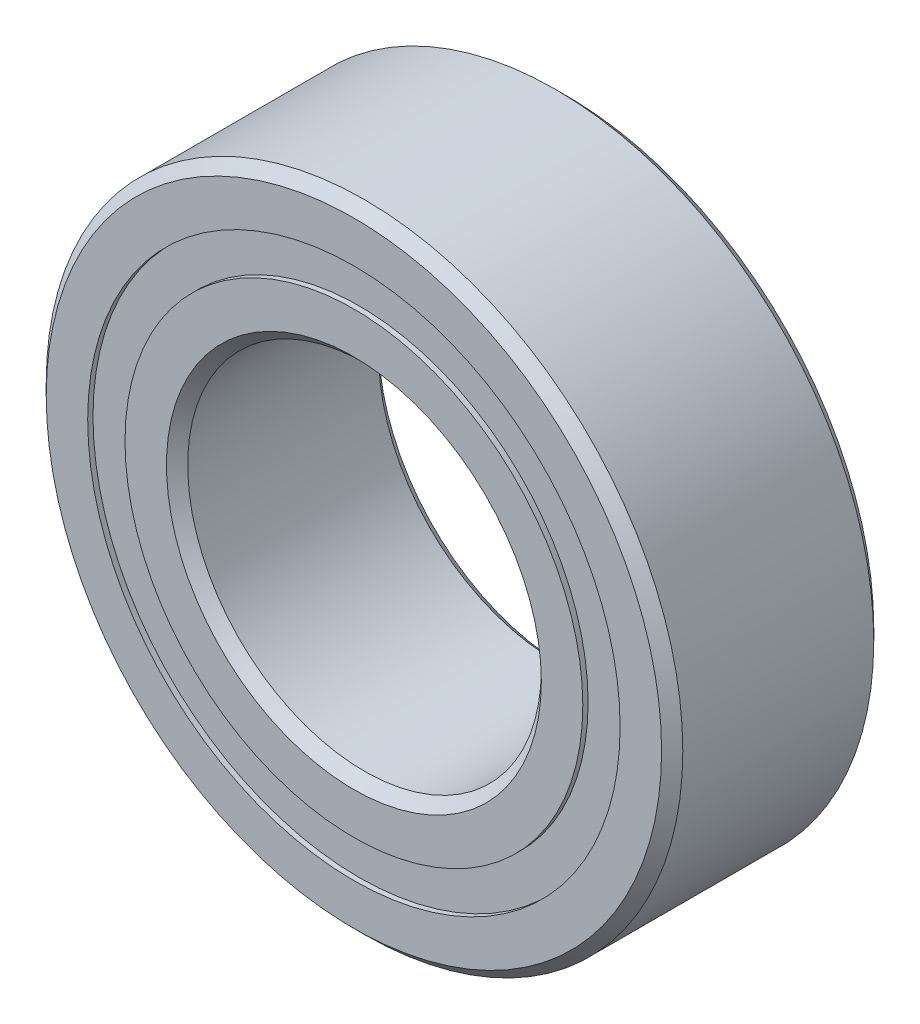
ISO-10303-21;
HEADER;
FILE_DESCRIPTION(('STEP AP214'),'2;1');
FILE_NAME('part.step','',(''),(''),'','','');
FILE_SCHEMA(('AUTOMOTIVE_DESIGN { 1 0 10303 214 1 1 1 1 }'));
ENDSEC;
DATA;
#1=APPLICATION_CONTEXT('core data for automotive mechanical design processes');
#2=APPLICATION_PROTOCOL_DEFINITION('international standard','automotive_design',2000,#1);
#3=PRODUCT_CONTEXT('',#1,'mechanical');
#4=PRODUCT('Part','Part','',(#3));
#5=PRODUCT_RELATED_PRODUCT_CATEGORY('part','',(#4));
#6=PRODUCT_DEFINITION_FORMATION('','',#4);
#7=PRODUCT_DEFINITION_CONTEXT('part definition',#1,'design');
#8=PRODUCT_DEFINITION('design','',#6,#7);
#9=PRODUCT_DEFINITION_SHAPE('','',#8);
#10=(LENGTH_UNIT() NAMED_UNIT(*) SI_UNIT(.MILLI.,.METRE.));
#11=(NAMED_UNIT(*) PLANE_ANGLE_UNIT() SI_UNIT($,.RADIAN.));
#12=(NAMED_UNIT(*) SI_UNIT($,.STERADIAN.) SOLID_ANGLE_UNIT());
#13=UNCERTAINTY_MEASURE_WITH_UNIT(LENGTH_MEASURE(1.E-05),#10,'distance_accuracy_value','');
#14=(GEOMETRIC_REPRESENTATION_CONTEXT(3) GLOBAL_UNCERTAINTY_ASSIGNED_CONTEXT((#13)) GLOBAL_UNIT_ASSIGNED_CONTEXT((#10,
#11,#12)) REPRESENTATION_CONTEXT('',''));
#15=CARTESIAN_POINT('',(0.,0.,0.));
#16=DIRECTION('',(0.,0.,1.));
#17=DIRECTION('',(1.,0.,0.));
#18=AXIS2_PLACEMENT_3D('',#15,#16,#17);
#19=CARTESIAN_POINT('',(0.,3.76373626373626,-1.425));
#20=DIRECTION('',(0.,0.,1.));
#21=DIRECTION('',(1.,0.,0.));
#22=AXIS2_PLACEMENT_3D('',#19,#20,#21);
#23=PLANE('',#22);
#24=CARTESIAN_POINT('',(0.,0.,-1.425));
#25=DIRECTION('',(0.,0.,1.));
#26=DIRECTION('',(1.,0.,0.));
#27=AXIS2_PLACEMENT_3D('',#24,#25,#26);
#28=CIRCLE('',#27,3.76373626373626);
#29=CARTESIAN_POINT('',(3.76373626373626,0.,-1.425));
#30=VERTEX_POINT('',#29);
#31=EDGE_CURVE('E59',#30,#30,#28,.T.);
#32=ORIENTED_EDGE('',*,*,#31,.F.);
#33=EDGE_LOOP('',(#32));
#34=FACE_BOUND('',#33,.T.);
#35=CARTESIAN_POINT('',(0.,0.,-1.425));
#36=DIRECTION('',(0.,0.,1.));
#37=DIRECTION('',(1.,0.,0.));
#38=AXIS2_PLACEMENT_3D('',#35,#36,#37);
#39=CIRCLE('',#38,3.23626373626374);
#40=CARTESIAN_POINT('',(3.23626373626374,0.,-1.425));
#41=VERTEX_POINT('',#40);
#42=EDGE_CURVE('E11',#41,#41,#39,.T.);
#43=ORIENTED_EDGE('',*,*,#42,.T.);
#44=EDGE_LOOP('',(#43));
#45=FACE_BOUND('',#44,.T.);
#46=ADVANCED_FACE('F45',(#34,#45),#23,.F.);
#47=CARTESIAN_POINT('',(0.,0.,1.5));
#48=DIRECTION('',(0.,0.,1.));
#49=DIRECTION('',(1.,0.,0.));
#50=AXIS2_PLACEMENT_3D('',#47,#48,#49);
#51=CYLINDRICAL_SURFACE('',#50,3.23626373626374);
#52=ORIENTED_EDGE('',*,*,#42,.F.);
#53=EDGE_LOOP('',(#52));
#54=FACE_BOUND('',#53,.T.);
#55=CARTESIAN_POINT('',(0.,0.,-0.716938812768572));
#56=DIRECTION('',(0.,0.,1.));
#57=DIRECTION('',(1.,0.,0.));
#58=AXIS2_PLACEMENT_3D('',#55,#56,#57);
#59=CIRCLE('',#58,3.23626373626374);
#60=CARTESIAN_POINT('',(3.23626373626374,0.,-0.716938812768572));
#61=VERTEX_POINT('',#60);
#62=EDGE_CURVE('E51',#61,#61,#59,.T.);
#63=ORIENTED_EDGE('',*,*,#62,.T.);
#64=EDGE_LOOP('',(#63));
#65=FACE_BOUND('',#64,.T.);
#66=ADVANCED_FACE('F68',(#54,#65),#51,.F.);
#67=CARTESIAN_POINT('',(0.,3.76373626373626,-0.716938812768571));
#68=DIRECTION('',(0.,0.,-1.));
#69=DIRECTION('',(-1.,0.,0.));
#70=AXIS2_PLACEMENT_3D('',#67,#68,#69);
#71=PLANE('',#70);
#72=ORIENTED_EDGE('',*,*,#62,.F.);
#73=EDGE_LOOP('',(#72));
#74=FACE_BOUND('',#73,.T.);
#75=CARTESIAN_POINT('',(0.,0.,-0.716938812768571));
#76=DIRECTION('',(0.,0.,1.));
#77=DIRECTION('',(1.,0.,0.));
#78=AXIS2_PLACEMENT_3D('',#75,#76,#77);
#79=CIRCLE('',#78,3.76373626373626);
#80=CARTESIAN_POINT('',(3.76373626373626,0.,-0.716938812768571));
#81=VERTEX_POINT('',#80);
#82=EDGE_CURVE('E55',#81,#81,#79,.T.);
#83=ORIENTED_EDGE('',*,*,#82,.T.);
#84=EDGE_LOOP('',(#83));
#85=FACE_BOUND('',#84,.T.);
#86=ADVANCED_FACE('F72',(#74,#85),#71,.F.);
#87=CARTESIAN_POINT('',(0.,0.,1.5));
#88=DIRECTION('',(0.,0.,1.));
#89=DIRECTION('',(1.,0.,0.));
#90=AXIS2_PLACEMENT_3D('',#87,#88,#89);
#91=CYLINDRICAL_SURFACE('',#90,3.76373626373626);
#92=ORIENTED_EDGE('',*,*,#82,.F.);
#93=EDGE_LOOP('',(#92));
#94=FACE_BOUND('',#93,.T.);
#95=ORIENTED_EDGE('',*,*,#31,.T.);
#96=EDGE_LOOP('',(#95));
#97=FACE_BOUND('',#96,.T.);
#98=ADVANCED_FACE('F65',(#94,#97),#91,.T.);
#99=CLOSED_SHELL('',(#46,#66,#86,#98));
#100=MANIFOLD_SOLID_BREP('B2',#99);
#101=CARTESIAN_POINT('',(0.,3.76373626373626,1.425));
#102=DIRECTION('',(0.,0.,-1.));
#103=DIRECTION('',(-1.,0.,0.));
#104=AXIS2_PLACEMENT_3D('',#101,#102,#103);
#105=PLANE('',#104);
#106=CARTESIAN_POINT('',(0.,0.,1.425));
#107=DIRECTION('',(0.,0.,1.));
#108=DIRECTION('',(1.,0.,0.));
#109=AXIS2_PLACEMENT_3D('',#106,#107,#108);
#110=CIRCLE('',#109,3.23626373626374);
#111=CARTESIAN_POINT('',(3.23626373626374,0.,1.425));
#112=VERTEX_POINT('',#111);
#113=EDGE_CURVE('E44',#112,#112,#110,.T.);
#114=ORIENTED_EDGE('',*,*,#113,.F.);
#115=EDGE_LOOP('',(#114));
#116=FACE_BOUND('',#115,.T.);
#117=CARTESIAN_POINT('',(0.,0.,1.425));
#118=DIRECTION('',(0.,0.,1.));
#119=DIRECTION('',(1.,0.,0.));
#120=AXIS2_PLACEMENT_3D('',#117,#118,#119);
#121=CIRCLE('',#120,3.76373626373626);
#122=CARTESIAN_POINT('',(3.76373626373626,0.,1.425));
#123=VERTEX_POINT('',#122);
#124=EDGE_CURVE('E126',#123,#123,#121,.T.);
#125=ORIENTED_EDGE('',*,*,#124,.T.);
#126=EDGE_LOOP('',(#125));
#127=FACE_BOUND('',#126,.T.);
#128=ADVANCED_FACE('F112',(#116,#127),#105,.F.);
#129=CARTESIAN_POINT('',(0.,0.,1.5));
#130=DIRECTION('',(0.,0.,1.));
#131=DIRECTION('',(1.,0.,0.));
#132=AXIS2_PLACEMENT_3D('',#129,#130,#131);
#133=CYLINDRICAL_SURFACE('',#132,3.23626373626374);
#134=CARTESIAN_POINT('',(0.,0.,0.716938812768571));
#135=DIRECTION('',(0.,0.,1.));
#136=DIRECTION('',(1.,0.,0.));
#137=AXIS2_PLACEMENT_3D('',#134,#135,#136);
#138=CIRCLE('',#137,3.23626373626374);
#139=CARTESIAN_POINT('',(3.23626373626374,0.,0.716938812768571));
#140=VERTEX_POINT('',#139);
#141=EDGE_CURVE('E118',#140,#140,#138,.T.);
#142=ORIENTED_EDGE('',*,*,#141,.F.);
#143=EDGE_LOOP('',(#142));
#144=FACE_BOUND('',#143,.T.);
#145=ORIENTED_EDGE('',*,*,#113,.T.);
#146=EDGE_LOOP('',(#145));
#147=FACE_BOUND('',#146,.T.);
#148=ADVANCED_FACE('F141',(#144,#147),#133,.F.);
#149=CARTESIAN_POINT('',(0.,3.76373626373626,0.716938812768571));
#150=DIRECTION('',(0.,0.,1.));
#151=DIRECTION('',(1.,0.,0.));
#152=AXIS2_PLACEMENT_3D('',#149,#150,#151);
#153=PLANE('',#152);
#154=CARTESIAN_POINT('',(0.,0.,0.716938812768571));
#155=DIRECTION('',(0.,0.,1.));
#156=DIRECTION('',(1.,0.,0.));
#157=AXIS2_PLACEMENT_3D('',#154,#155,#156);
#158=CIRCLE('',#157,3.76373626373626);
#159=CARTESIAN_POINT('',(3.76373626373626,0.,0.716938812768571));
#160=VERTEX_POINT('',#159);
#161=EDGE_CURVE('E122',#160,#160,#158,.T.);
#162=ORIENTED_EDGE('',*,*,#161,.F.);
#163=EDGE_LOOP('',(#162));
#164=FACE_BOUND('',#163,.T.);
#165=ORIENTED_EDGE('',*,*,#141,.T.);
#166=EDGE_LOOP('',(#165));
#167=FACE_BOUND('',#166,.T.);
#168=ADVANCED_FACE('F136',(#164,#167),#153,.F.);
#169=CARTESIAN_POINT('',(0.,0.,1.5));
#170=DIRECTION('',(0.,0.,1.));
#171=DIRECTION('',(1.,0.,0.));
#172=AXIS2_PLACEMENT_3D('',#169,#170,#171);
#173=CYLINDRICAL_SURFACE('',#172,3.76373626373626);
#174=ORIENTED_EDGE('',*,*,#124,.F.);
#175=EDGE_LOOP('',(#174));
#176=FACE_BOUND('',#175,.T.);
#177=ORIENTED_EDGE('',*,*,#161,.T.);
#178=EDGE_LOOP('',(#177));
#179=FACE_BOUND('',#178,.T.);
#180=ADVANCED_FACE('F133',(#176,#179),#173,.T.);
#181=CLOSED_SHELL('',(#128,#148,#168,#180));
#182=MANIFOLD_SOLID_BREP('B6',#181);
#183=CARTESIAN_POINT('',(-1.74999999999996,3.03108891324556,0.));
#184=DIRECTION('',(0.,0.,1.));
#185=DIRECTION('',(-0.499999999999989,0.866025403784445,0.));
#186=AXIS2_PLACEMENT_3D('',#183,#184,#185);
#187=SPHERICAL_SURFACE('',#186,0.716938812768571);
#188=CARTESIAN_POINT('',(-1.74999999999996,3.03108891324556,0.716938812768571));
#189=VERTEX_POINT('',#188);
#190=VERTEX_LOOP('',#189);
#191=FACE_BOUND('',#190,.T.);
#192=ADVANCED_FACE('F179',(#191),#187,.T.);
#193=CLOSED_SHELL('',(#192));
#194=MANIFOLD_SOLID_BREP('B39',#193);
#195=CARTESIAN_POINT('',(-3.03108891324551,1.75000000000004,0.));
#196=DIRECTION('',(0.,0.,1.));
#197=DIRECTION('',(-0.866025403784433,0.50000000000001,0.));
#198=AXIS2_PLACEMENT_3D('',#195,#196,#197);
#199=SPHERICAL_SURFACE('',#198,0.716938812768571);
#200=CARTESIAN_POINT('',(-3.03108891324551,1.75000000000004,0.716938812768571));
#201=VERTEX_POINT('',#200);
#202=VERTEX_LOOP('',#201);
#203=FACE_BOUND('',#202,.T.);
#204=ADVANCED_FACE('F199',(#203),#199,.T.);
#205=CLOSED_SHELL('',(#204));
#206=MANIFOLD_SOLID_BREP('B108',#205);
#207=CARTESIAN_POINT('',(-3.5,0.,0.));
#208=DIRECTION('',(0.,0.,1.));
#209=DIRECTION('',(-1.,0.,0.));
#210=AXIS2_PLACEMENT_3D('',#207,#208,#209);
#211=SPHERICAL_SURFACE('',#210,0.716938812768571);
#212=CARTESIAN_POINT('',(-3.5,0.,0.716938812768571));
#213=VERTEX_POINT('',#212);
#214=VERTEX_LOOP('',#213);
#215=FACE_BOUND('',#214,.T.);
#216=ADVANCED_FACE('F219',(#215),#211,.T.);
#217=CLOSED_SHELL('',(#216));
#218=MANIFOLD_SOLID_BREP('B175',#217);
#219=CARTESIAN_POINT('',(-3.03108891324555,-1.74999999999997,0.));
#220=DIRECTION('',(0.,0.,1.));
#221=DIRECTION('',(-0.866025403784443,-0.499999999999992,0.));
#222=AXIS2_PLACEMENT_3D('',#219,#220,#221);
#223=SPHERICAL_SURFACE('',#222,0.716938812768571);
#224=CARTESIAN_POINT('',(-3.03108891324555,-1.74999999999997,0.716938812768571));
#225=VERTEX_POINT('',#224);
#226=VERTEX_LOOP('',#225);
#227=FACE_BOUND('',#226,.T.);
#228=ADVANCED_FACE('F239',(#227),#223,.T.);
#229=CLOSED_SHELL('',(#228));
#230=MANIFOLD_SOLID_BREP('B195',#229);
#231=CARTESIAN_POINT('',(-1.75000000000002,-3.03108891324552,0.));
#232=DIRECTION('',(0.,0.,1.));
#233=DIRECTION('',(-0.500000000000007,-0.866025403784435,0.));
#234=AXIS2_PLACEMENT_3D('',#231,#232,#233);
#235=SPHERICAL_SURFACE('',#234,0.716938812768571);
#236=CARTESIAN_POINT('',(-1.75000000000002,-3.03108891324552,0.716938812768571));
#237=VERTEX_POINT('',#236);
#238=VERTEX_LOOP('',#237);
#239=FACE_BOUND('',#238,.T.);
#240=ADVANCED_FACE('F259',(#239),#235,.T.);
#241=CLOSED_SHELL('',(#240));
#242=MANIFOLD_SOLID_BREP('B215',#241);
#243=CARTESIAN_POINT('',(0.,-3.5,0.));
#244=DIRECTION('',(0.,0.,1.));
#245=DIRECTION('',(0.,-1.,0.));
#246=AXIS2_PLACEMENT_3D('',#243,#244,#245);
#247=SPHERICAL_SURFACE('',#246,0.716938812768571);
#248=CARTESIAN_POINT('',(0.,-3.5,0.716938812768571));
#249=VERTEX_POINT('',#248);
#250=VERTEX_LOOP('',#249);
#251=FACE_BOUND('',#250,.T.);
#252=ADVANCED_FACE('F279',(#251),#247,.T.);
#253=CLOSED_SHELL('',(#252));
#254=MANIFOLD_SOLID_BREP('B235',#253);
#255=CARTESIAN_POINT('',(1.74999999999998,-3.03108891324554,0.));
#256=DIRECTION('',(0.,0.,1.));
#257=DIRECTION('',(0.499999999999995,-0.866025403784442,0.));
#258=AXIS2_PLACEMENT_3D('',#255,#256,#257);
#259=SPHERICAL_SURFACE('',#258,0.716938812768571);
#260=CARTESIAN_POINT('',(1.74999999999998,-3.03108891324554,0.716938812768571));
#261=VERTEX_POINT('',#260);
#262=VERTEX_LOOP('',#261);
#263=FACE_BOUND('',#262,.T.);
#264=ADVANCED_FACE('F299',(#263),#259,.T.);
#265=CLOSED_SHELL('',(#264));
#266=MANIFOLD_SOLID_BREP('B255',#265);
#267=CARTESIAN_POINT('',(3.03108891324553,-1.75000000000001,0.));
#268=DIRECTION('',(0.,0.,1.));
#269=DIRECTION('',(0.866025403784436,-0.500000000000004,0.));
#270=AXIS2_PLACEMENT_3D('',#267,#268,#269);
#271=SPHERICAL_SURFACE('',#270,0.716938812768571);
#272=CARTESIAN_POINT('',(3.03108891324553,-1.75000000000001,0.716938812768571));
#273=VERTEX_POINT('',#272);
#274=VERTEX_LOOP('',#273);
#275=FACE_BOUND('',#274,.T.);
#276=ADVANCED_FACE('F319',(#275),#271,.T.);
#277=CLOSED_SHELL('',(#276));
#278=MANIFOLD_SOLID_BREP('B275',#277);
#279=CARTESIAN_POINT('',(3.5,0.,0.));
#280=DIRECTION('',(0.,0.,1.));
#281=DIRECTION('',(1.,0.,0.));
#282=AXIS2_PLACEMENT_3D('',#279,#280,#281);
#283=SPHERICAL_SURFACE('',#282,0.716938812768571);
#284=CARTESIAN_POINT('',(3.5,0.,0.716938812768571));
#285=VERTEX_POINT('',#284);
#286=VERTEX_LOOP('',#285);
#287=FACE_BOUND('',#286,.T.);
#288=ADVANCED_FACE('F339',(#287),#283,.T.);
#289=CLOSED_SHELL('',(#288));
#290=MANIFOLD_SOLID_BREP('B295',#289);
#291=CARTESIAN_POINT('',(3.03108891324554,1.74999999999999,0.));
#292=DIRECTION('',(0.,0.,1.));
#293=DIRECTION('',(0.86602540378444,0.499999999999998,0.));
#294=AXIS2_PLACEMENT_3D('',#291,#292,#293);
#295=SPHERICAL_SURFACE('',#294,0.716938812768571);
#296=CARTESIAN_POINT('',(3.03108891324554,1.74999999999999,0.716938812768571));
#297=VERTEX_POINT('',#296);
#298=VERTEX_LOOP('',#297);
#299=FACE_BOUND('',#298,.T.);
#300=ADVANCED_FACE('F359',(#299),#295,.T.);
#301=CLOSED_SHELL('',(#300));
#302=MANIFOLD_SOLID_BREP('B315',#301);
#303=CARTESIAN_POINT('',(1.75,3.03108891324553,0.));
#304=DIRECTION('',(0.,0.,1.));
#305=DIRECTION('',(0.500000000000001,0.866025403784438,0.));
#306=AXIS2_PLACEMENT_3D('',#303,#304,#305);
#307=SPHERICAL_SURFACE('',#306,0.716938812768571);
#308=CARTESIAN_POINT('',(1.75,3.03108891324553,0.716938812768571));
#309=VERTEX_POINT('',#308);
#310=VERTEX_LOOP('',#309);
#311=FACE_BOUND('',#310,.T.);
#312=ADVANCED_FACE('F379',(#311),#307,.T.);
#313=CLOSED_SHELL('',(#312));
#314=MANIFOLD_SOLID_BREP('B335',#313);
#315=CARTESIAN_POINT('',(0.,3.5,0.));
#316=DIRECTION('',(0.,0.,1.));
#317=DIRECTION('',(0.,1.,0.));
#318=AXIS2_PLACEMENT_3D('',#315,#316,#317);
#319=SPHERICAL_SURFACE('',#318,0.716938812768571);
#320=CARTESIAN_POINT('',(0.,3.5,0.716938812768571));
#321=VERTEX_POINT('',#320);
#322=VERTEX_LOOP('',#321);
#323=FACE_BOUND('',#322,.T.);
#324=ADVANCED_FACE('F401',(#323),#319,.T.);
#325=CLOSED_SHELL('',(#324));
#326=MANIFOLD_SOLID_BREP('B355',#325);
#327=CARTESIAN_POINT('',(0.,3.23626373626374,1.5));
#328=DIRECTION('',(0.,0.,-1.));
#329=DIRECTION('',(-1.,0.,0.));
#330=AXIS2_PLACEMENT_3D('',#327,#328,#329);
#331=PLANE('',#330);
#332=CARTESIAN_POINT('',(0.,0.,1.5));
#333=DIRECTION('',(0.,0.,1.));
#334=DIRECTION('',(1.,0.,0.));
#335=AXIS2_PLACEMENT_3D('',#332,#333,#334);
#336=CIRCLE('',#335,2.65);
#337=CARTESIAN_POINT('',(2.65,0.,1.5));
#338=VERTEX_POINT('',#337);
#339=EDGE_CURVE('E448',#338,#338,#336,.T.);
#340=ORIENTED_EDGE('',*,*,#339,.F.);
#341=EDGE_LOOP('',(#340));
#342=FACE_BOUND('',#341,.T.);
#343=CARTESIAN_POINT('',(0.,0.,1.5));
#344=DIRECTION('',(0.,0.,1.));
#345=DIRECTION('',(1.,0.,0.));
#346=AXIS2_PLACEMENT_3D('',#343,#344,#345);
#347=CIRCLE('',#346,3.23626373626374);
#348=CARTESIAN_POINT('',(3.23626373626374,0.,1.5));
#349=VERTEX_POINT('',#348);
#350=EDGE_CURVE('E400',#349,#349,#347,.T.);
#351=ORIENTED_EDGE('',*,*,#350,.T.);
#352=EDGE_LOOP('',(#351));
#353=FACE_BOUND('',#352,.T.);
#354=ADVANCED_FACE('F420',(#342,#353),#331,.F.);
#355=CARTESIAN_POINT('',(0.,0.,1.5));
#356=DIRECTION('',(0.,0.,1.));
#357=DIRECTION('',(1.,0.,0.));
#358=AXIS2_PLACEMENT_3D('',#355,#356,#357);
#359=CYLINDRICAL_SURFACE('',#358,3.23626373626374);
#360=ORIENTED_EDGE('',*,*,#350,.F.);
#361=EDGE_LOOP('',(#360));
#362=FACE_BOUND('',#361,.T.);
#363=CARTESIAN_POINT('',(0.,0.,0.666666666666667));
#364=DIRECTION('',(0.,0.,1.));
#365=DIRECTION('',(1.,0.,0.));
#366=AXIS2_PLACEMENT_3D('',#363,#364,#365);
#367=CIRCLE('',#366,3.23626373626374);
#368=CARTESIAN_POINT('',(3.23626373626374,0.,0.666666666666667));
#369=VERTEX_POINT('',#368);
#370=EDGE_CURVE('E426',#369,#369,#367,.T.);
#371=ORIENTED_EDGE('',*,*,#370,.T.);
#372=EDGE_LOOP('',(#371));
#373=FACE_BOUND('',#372,.T.);
#374=ADVANCED_FACE('F455',(#362,#373),#359,.T.);
#375=CARTESIAN_POINT('',(0.,0.,0.));
#376=DIRECTION('',(0.,0.,1.));
#377=DIRECTION('',(1.,0.,0.));
#378=AXIS2_PLACEMENT_3D('',#375,#376,#377);
#379=TOROIDAL_SURFACE('',#378,3.5,0.71693881276857);
#380=ORIENTED_EDGE('',*,*,#370,.F.);
#381=EDGE_LOOP('',(#380));
#382=FACE_BOUND('',#381,.T.);
#383=CARTESIAN_POINT('',(0.,0.,-0.666666666666667));
#384=DIRECTION('',(0.,0.,1.));
#385=DIRECTION('',(1.,0.,0.));
#386=AXIS2_PLACEMENT_3D('',#383,#384,#385);
#387=CIRCLE('',#386,3.23626373626374);
#388=CARTESIAN_POINT('',(3.23626373626374,0.,-0.666666666666667));
#389=VERTEX_POINT('',#388);
#390=EDGE_CURVE('E430',#389,#389,#387,.T.);
#391=ORIENTED_EDGE('',*,*,#390,.T.);
#392=EDGE_LOOP('',(#391));
#393=FACE_BOUND('',#392,.T.);
#394=ADVANCED_FACE('F459',(#382,#393),#379,.F.);
#395=CARTESIAN_POINT('',(0.,0.,1.5));
#396=DIRECTION('',(0.,0.,1.));
#397=DIRECTION('',(1.,0.,0.));
#398=AXIS2_PLACEMENT_3D('',#395,#396,#397);
#399=CYLINDRICAL_SURFACE('',#398,3.23626373626374);
#400=ORIENTED_EDGE('',*,*,#390,.F.);
#401=EDGE_LOOP('',(#400));
#402=FACE_BOUND('',#401,.T.);
#403=CARTESIAN_POINT('',(0.,0.,-1.5));
#404=DIRECTION('',(0.,0.,1.));
#405=DIRECTION('',(1.,0.,0.));
#406=AXIS2_PLACEMENT_3D('',#403,#404,#405);
#407=CIRCLE('',#406,3.23626373626374);
#408=CARTESIAN_POINT('',(3.23626373626374,0.,-1.5));
#409=VERTEX_POINT('',#408);
#410=EDGE_CURVE('E434',#409,#409,#407,.T.);
#411=ORIENTED_EDGE('',*,*,#410,.T.);
#412=EDGE_LOOP('',(#411));
#413=FACE_BOUND('',#412,.T.);
#414=ADVANCED_FACE('F464',(#402,#413),#399,.T.);
#415=CARTESIAN_POINT('',(0.,2.65,-1.5));
#416=DIRECTION('',(0.,0.,1.));
#417=DIRECTION('',(1.,0.,0.));
#418=AXIS2_PLACEMENT_3D('',#415,#416,#417);
#419=PLANE('',#418);
#420=ORIENTED_EDGE('',*,*,#410,.F.);
#421=EDGE_LOOP('',(#420));
#422=FACE_BOUND('',#421,.T.);
#423=CARTESIAN_POINT('',(0.,0.,-1.5));
#424=DIRECTION('',(0.,0.,1.));
#425=DIRECTION('',(1.,0.,0.));
#426=AXIS2_PLACEMENT_3D('',#423,#424,#425);
#427=CIRCLE('',#426,2.65);
#428=CARTESIAN_POINT('',(2.65,0.,-1.5));
#429=VERTEX_POINT('',#428);
#430=EDGE_CURVE('E439',#429,#429,#427,.T.);
#431=ORIENTED_EDGE('',*,*,#430,.T.);
#432=EDGE_LOOP('',(#431));
#433=FACE_BOUND('',#432,.T.);
#434=ADVANCED_FACE('F470',(#422,#433),#419,.F.);
#435=CARTESIAN_POINT('',(0.,0.,-1.35));
#436=DIRECTION('',(0.,0.,-1.));
#437=DIRECTION('',(-1.,0.,0.));
#438=AXIS2_PLACEMENT_3D('',#435,#436,#437);
#439=CONICAL_SURFACE('',#438,2.5,0.785398163397445);
#440=ORIENTED_EDGE('',*,*,#430,.F.);
#441=EDGE_LOOP('',(#440));
#442=FACE_BOUND('',#441,.T.);
#443=CARTESIAN_POINT('',(0.,0.,-1.35));
#444=DIRECTION('',(0.,0.,1.));
#445=DIRECTION('',(1.,0.,0.));
#446=AXIS2_PLACEMENT_3D('',#443,#444,#445);
#447=CIRCLE('',#446,2.5);
#448=CARTESIAN_POINT('',(2.5,0.,-1.35));
#449=VERTEX_POINT('',#448);
#450=EDGE_CURVE('E442',#449,#449,#447,.T.);
#451=ORIENTED_EDGE('',*,*,#450,.T.);
#452=EDGE_LOOP('',(#451));
#453=FACE_BOUND('',#452,.T.);
#454=ADVANCED_FACE('F474',(#442,#453),#439,.F.);
#455=CARTESIAN_POINT('',(0.,0.,1.5));
#456=DIRECTION('',(0.,0.,1.));
#457=DIRECTION('',(1.,0.,0.));
#458=AXIS2_PLACEMENT_3D('',#455,#456,#457);
#459=CYLINDRICAL_SURFACE('',#458,2.5);
#460=ORIENTED_EDGE('',*,*,#450,.F.);
#461=EDGE_LOOP('',(#460));
#462=FACE_BOUND('',#461,.T.);
#463=CARTESIAN_POINT('',(0.,0.,1.35));
#464=DIRECTION('',(0.,0.,1.));
#465=DIRECTION('',(1.,0.,0.));
#466=AXIS2_PLACEMENT_3D('',#463,#464,#465);
#467=CIRCLE('',#466,2.5);
#468=CARTESIAN_POINT('',(2.5,0.,1.35));
#469=VERTEX_POINT('',#468);
#470=EDGE_CURVE('E445',#469,#469,#467,.T.);
#471=ORIENTED_EDGE('',*,*,#470,.T.);
#472=EDGE_LOOP('',(#471));
#473=FACE_BOUND('',#472,.T.);
#474=ADVANCED_FACE('F478',(#462,#473),#459,.F.);
#475=CARTESIAN_POINT('',(0.,0.,1.5));
#476=DIRECTION('',(0.,0.,1.));
#477=DIRECTION('',(1.,0.,0.));
#478=AXIS2_PLACEMENT_3D('',#475,#476,#477);
#479=CONICAL_SURFACE('',#478,2.65,0.785398163397451);
#480=ORIENTED_EDGE('',*,*,#470,.F.);
#481=EDGE_LOOP('',(#480));
#482=FACE_BOUND('',#481,.T.);
#483=ORIENTED_EDGE('',*,*,#339,.T.);
#484=EDGE_LOOP('',(#483));
#485=FACE_BOUND('',#484,.T.);
#486=ADVANCED_FACE('F452',(#482,#485),#479,.F.);
#487=CLOSED_SHELL('',(#354,#374,#394,#414,#434,#454,#474,#486));
#488=MANIFOLD_SOLID_BREP('B375',#487);
#489=CARTESIAN_POINT('',(0.,0.,1.35));
#490=DIRECTION('',(0.,0.,-1.));
#491=DIRECTION('',(-1.,0.,0.));
#492=AXIS2_PLACEMENT_3D('',#489,#490,#491);
#493=CONICAL_SURFACE('',#492,4.5,0.785398163397445);
#494=CARTESIAN_POINT('',(0.,0.,1.5));
#495=DIRECTION('',(0.,0.,1.));
#496=DIRECTION('',(1.,0.,0.));
#497=AXIS2_PLACEMENT_3D('',#494,#495,#496);
#498=CIRCLE('',#497,4.35);
#499=CARTESIAN_POINT('',(4.35,0.,1.5));
#500=VERTEX_POINT('',#499);
#501=EDGE_CURVE('E569',#500,#500,#498,.T.);
#502=ORIENTED_EDGE('',*,*,#501,.F.);
#503=EDGE_LOOP('',(#502));
#504=FACE_BOUND('',#503,.T.);
#505=CARTESIAN_POINT('',(0.,0.,1.35));
#506=DIRECTION('',(0.,0.,1.));
#507=DIRECTION('',(1.,0.,0.));
#508=AXIS2_PLACEMENT_3D('',#505,#506,#507);
#509=CIRCLE('',#508,4.5);
#510=CARTESIAN_POINT('',(4.5,0.,1.35));
#511=VERTEX_POINT('',#510);
#512=EDGE_CURVE('E419',#511,#511,#509,.T.);
#513=ORIENTED_EDGE('',*,*,#512,.T.);
#514=EDGE_LOOP('',(#513));
#515=FACE_BOUND('',#514,.T.);
#516=ADVANCED_FACE('F541',(#504,#515),#493,.T.);
#517=CARTESIAN_POINT('',(0.,0.,1.5));
#518=DIRECTION('',(0.,0.,1.));
#519=DIRECTION('',(1.,0.,0.));
#520=AXIS2_PLACEMENT_3D('',#517,#518,#519);
#521=CYLINDRICAL_SURFACE('',#520,4.5);
#522=ORIENTED_EDGE('',*,*,#512,.F.);
#523=EDGE_LOOP('',(#522));
#524=FACE_BOUND('',#523,.T.);
#525=CARTESIAN_POINT('',(0.,0.,-1.35));
#526=DIRECTION('',(0.,0.,1.));
#527=DIRECTION('',(1.,0.,0.));
#528=AXIS2_PLACEMENT_3D('',#525,#526,#527);
#529=CIRCLE('',#528,4.5);
#530=CARTESIAN_POINT('',(4.5,0.,-1.35));
#531=VERTEX_POINT('',#530);
#532=EDGE_CURVE('E547',#531,#531,#529,.T.);
#533=ORIENTED_EDGE('',*,*,#532,.T.);
#534=EDGE_LOOP('',(#533));
#535=FACE_BOUND('',#534,.T.);
#536=ADVANCED_FACE('F576',(#524,#535),#521,.T.);
#537=CARTESIAN_POINT('',(0.,0.,-1.5));
#538=DIRECTION('',(0.,0.,1.));
#539=DIRECTION('',(1.,0.,0.));
#540=AXIS2_PLACEMENT_3D('',#537,#538,#539);
#541=CONICAL_SURFACE('',#540,4.35,0.785398163397445);
#542=ORIENTED_EDGE('',*,*,#532,.F.);
#543=EDGE_LOOP('',(#542));
#544=FACE_BOUND('',#543,.T.);
#545=CARTESIAN_POINT('',(0.,0.,-1.5));
#546=DIRECTION('',(0.,0.,1.));
#547=DIRECTION('',(1.,0.,0.));
#548=AXIS2_PLACEMENT_3D('',#545,#546,#547);
#549=CIRCLE('',#548,4.35);
#550=CARTESIAN_POINT('',(4.35,0.,-1.5));
#551=VERTEX_POINT('',#550);
#552=EDGE_CURVE('E551',#551,#551,#549,.T.);
#553=ORIENTED_EDGE('',*,*,#552,.T.);
#554=EDGE_LOOP('',(#553));
#555=FACE_BOUND('',#554,.T.);
#556=ADVANCED_FACE('F580',(#544,#555),#541,.T.);
#557=CARTESIAN_POINT('',(0.,4.35,-1.5));
#558=DIRECTION('',(0.,0.,1.));
#559=DIRECTION('',(1.,0.,0.));
#560=AXIS2_PLACEMENT_3D('',#557,#558,#559);
#561=PLANE('',#560);
#562=ORIENTED_EDGE('',*,*,#552,.F.);
#563=EDGE_LOOP('',(#562));
#564=FACE_BOUND('',#563,.T.);
#565=CARTESIAN_POINT('',(0.,0.,-1.5));
#566=DIRECTION('',(0.,0.,1.));
#567=DIRECTION('',(1.,0.,0.));
#568=AXIS2_PLACEMENT_3D('',#565,#566,#567);
#569=CIRCLE('',#568,3.76373626373626);
#570=CARTESIAN_POINT('',(3.76373626373626,0.,-1.5));
#571=VERTEX_POINT('',#570);
#572=EDGE_CURVE('E555',#571,#571,#569,.T.);
#573=ORIENTED_EDGE('',*,*,#572,.T.);
#574=EDGE_LOOP('',(#573));
#575=FACE_BOUND('',#574,.T.);
#576=ADVANCED_FACE('F585',(#564,#575),#561,.F.);
#577=CARTESIAN_POINT('',(0.,0.,1.5));
#578=DIRECTION('',(0.,0.,1.));
#579=DIRECTION('',(1.,0.,0.));
#580=AXIS2_PLACEMENT_3D('',#577,#578,#579);
#581=CYLINDRICAL_SURFACE('',#580,3.76373626373626);
#582=ORIENTED_EDGE('',*,*,#572,.F.);
#583=EDGE_LOOP('',(#582));
#584=FACE_BOUND('',#583,.T.);
#585=CARTESIAN_POINT('',(0.,0.,-0.666666666666667));
#586=DIRECTION('',(0.,0.,1.));
#587=DIRECTION('',(1.,0.,0.));
#588=AXIS2_PLACEMENT_3D('',#585,#586,#587);
#589=CIRCLE('',#588,3.76373626373626);
#590=CARTESIAN_POINT('',(3.76373626373626,0.,-0.666666666666667));
#591=VERTEX_POINT('',#590);
#592=EDGE_CURVE('E560',#591,#591,#589,.T.);
#593=ORIENTED_EDGE('',*,*,#592,.T.);
#594=EDGE_LOOP('',(#593));
#595=FACE_BOUND('',#594,.T.);
#596=ADVANCED_FACE('F591',(#584,#595),#581,.F.);
#597=CARTESIAN_POINT('',(0.,0.,0.));
#598=DIRECTION('',(0.,0.,1.));
#599=DIRECTION('',(1.,0.,0.));
#600=AXIS2_PLACEMENT_3D('',#597,#598,#599);
#601=TOROIDAL_SURFACE('',#600,3.5,0.716938812768571);
#602=ORIENTED_EDGE('',*,*,#592,.F.);
#603=EDGE_LOOP('',(#602));
#604=FACE_BOUND('',#603,.T.);
#605=CARTESIAN_POINT('',(0.,0.,0.666666666666667));
#606=DIRECTION('',(0.,0.,1.));
#607=DIRECTION('',(1.,0.,0.));
#608=AXIS2_PLACEMENT_3D('',#605,#606,#607);
#609=CIRCLE('',#608,3.76373626373626);
#610=CARTESIAN_POINT('',(3.76373626373626,0.,0.666666666666667));
#611=VERTEX_POINT('',#610);
#612=EDGE_CURVE('E563',#611,#611,#609,.T.);
#613=ORIENTED_EDGE('',*,*,#612,.T.);
#614=EDGE_LOOP('',(#613));
#615=FACE_BOUND('',#614,.T.);
#616=ADVANCED_FACE('F595',(#604,#615),#601,.F.);
#617=CARTESIAN_POINT('',(0.,0.,1.5));
#618=DIRECTION('',(0.,0.,1.));
#619=DIRECTION('',(1.,0.,0.));
#620=AXIS2_PLACEMENT_3D('',#617,#618,#619);
#621=CYLINDRICAL_SURFACE('',#620,3.76373626373626);
#622=ORIENTED_EDGE('',*,*,#612,.F.);
#623=EDGE_LOOP('',(#622));
#624=FACE_BOUND('',#623,.T.);
#625=CARTESIAN_POINT('',(0.,0.,1.5));
#626=DIRECTION('',(0.,0.,1.));
#627=DIRECTION('',(1.,0.,0.));
#628=AXIS2_PLACEMENT_3D('',#625,#626,#627);
#629=CIRCLE('',#628,3.76373626373626);
#630=CARTESIAN_POINT('',(3.76373626373626,0.,1.5));
#631=VERTEX_POINT('',#630);
#632=EDGE_CURVE('E566',#631,#631,#629,.T.);
#633=ORIENTED_EDGE('',*,*,#632,.T.);
#634=EDGE_LOOP('',(#633));
#635=FACE_BOUND('',#634,.T.);
#636=ADVANCED_FACE('F599',(#624,#635),#621,.F.);
#637=CARTESIAN_POINT('',(0.,4.35,1.5));
#638=DIRECTION('',(0.,0.,-1.));
#639=DIRECTION('',(-1.,0.,0.));
#640=AXIS2_PLACEMENT_3D('',#637,#638,#639);
#641=PLANE('',#640);
#642=ORIENTED_EDGE('',*,*,#632,.F.);
#643=EDGE_LOOP('',(#642));
#644=FACE_BOUND('',#643,.T.);
#645=ORIENTED_EDGE('',*,*,#501,.T.);
#646=EDGE_LOOP('',(#645));
#647=FACE_BOUND('',#646,.T.);
#648=ADVANCED_FACE('F573',(#644,#647),#641,.F.);
#649=CLOSED_SHELL('',(#516,#536,#556,#576,#596,#616,#636,#648));
#650=MANIFOLD_SOLID_BREP('B395',#649);
#651=ADVANCED_BREP_SHAPE_REPRESENTATION('',(#18,#100,#182,#194,#206,#218,#230,#242,#254,#266,
#278,#290,#302,#314,#326,#488,#650),#14);
#652=SHAPE_DEFINITION_REPRESENTATION(#9,#651);
ENDSEC;
END-ISO-10303-21;
